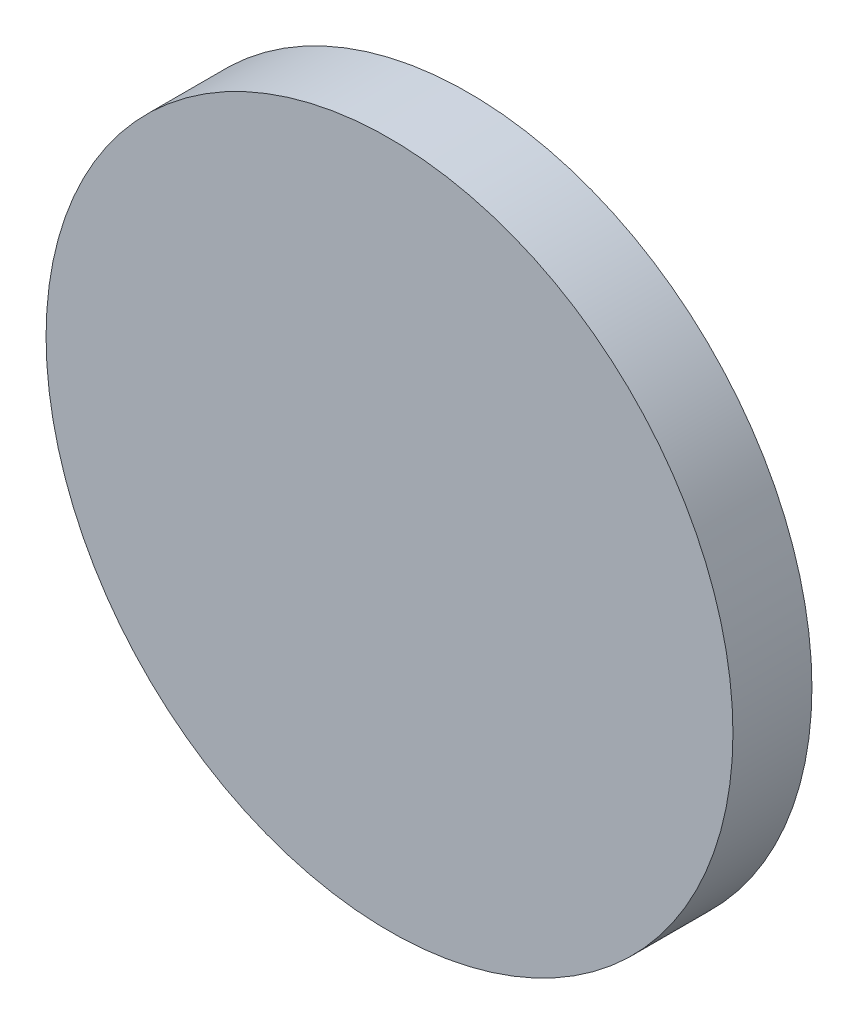
ISO-10303-21;
HEADER;
FILE_DESCRIPTION(('STEP AP214'),'2;1');
FILE_NAME('part.step','',(''),(''),'','','');
FILE_SCHEMA(('AUTOMOTIVE_DESIGN { 1 0 10303 214 1 1 1 1 }'));
ENDSEC;
DATA;
#1=APPLICATION_CONTEXT('core data for automotive mechanical design processes');
#2=APPLICATION_PROTOCOL_DEFINITION('international standard','automotive_design',2000,#1);
#3=PRODUCT_CONTEXT('',#1,'mechanical');
#4=PRODUCT('Part','Part','',(#3));
#5=PRODUCT_RELATED_PRODUCT_CATEGORY('part','',(#4));
#6=PRODUCT_DEFINITION_FORMATION('','',#4);
#7=PRODUCT_DEFINITION_CONTEXT('part definition',#1,'design');
#8=PRODUCT_DEFINITION('design','',#6,#7);
#9=PRODUCT_DEFINITION_SHAPE('','',#8);
#10=(LENGTH_UNIT() NAMED_UNIT(*) SI_UNIT(.MILLI.,.METRE.));
#11=(NAMED_UNIT(*) PLANE_ANGLE_UNIT() SI_UNIT($,.RADIAN.));
#12=(NAMED_UNIT(*) SI_UNIT($,.STERADIAN.) SOLID_ANGLE_UNIT());
#13=UNCERTAINTY_MEASURE_WITH_UNIT(LENGTH_MEASURE(1.E-05),#10,'distance_accuracy_value','');
#14=(GEOMETRIC_REPRESENTATION_CONTEXT(3) GLOBAL_UNCERTAINTY_ASSIGNED_CONTEXT((#13)) GLOBAL_UNIT_ASSIGNED_CONTEXT((#10,
#11,#12)) REPRESENTATION_CONTEXT('',''));
#15=CARTESIAN_POINT('',(0.,0.,0.));
#16=DIRECTION('',(0.,0.,1.));
#17=DIRECTION('',(1.,0.,0.));
#18=AXIS2_PLACEMENT_3D('',#15,#16,#17);
#19=CARTESIAN_POINT('',(72.4099892876148,41.0421612189135,2.3));
#20=DIRECTION('',(0.,0.,-1.));
#21=DIRECTION('',(-1.,0.,0.));
#22=AXIS2_PLACEMENT_3D('',#19,#20,#21);
#23=CYLINDRICAL_SURFACE('',#22,9.999999999);
#24=CARTESIAN_POINT('',(72.4099892876148,41.0421612189135,2.3));
#25=DIRECTION('',(0.,0.,1.));
#26=DIRECTION('',(1.,0.,0.));
#27=AXIS2_PLACEMENT_3D('',#24,#25,#26);
#28=CIRCLE('',#27,9.999999999);
#29=CARTESIAN_POINT('',(82.4099892866148,41.0421612189135,2.3));
#30=VERTEX_POINT('',#29);
#31=EDGE_CURVE('E10',#30,#30,#28,.T.);
#32=ORIENTED_EDGE('',*,*,#31,.F.);
#33=EDGE_LOOP('',(#32));
#34=FACE_BOUND('',#33,.T.);
#35=CARTESIAN_POINT('',(72.4099892876148,41.0421612189135,0.));
#36=DIRECTION('',(0.,0.,1.));
#37=DIRECTION('',(1.,0.,0.));
#38=AXIS2_PLACEMENT_3D('',#35,#36,#37);
#39=CIRCLE('',#38,9.999999999);
#40=CARTESIAN_POINT('',(82.4099892866148,41.0421612189135,0.));
#41=VERTEX_POINT('',#40);
#42=EDGE_CURVE('E38',#41,#41,#39,.T.);
#43=ORIENTED_EDGE('',*,*,#42,.T.);
#44=EDGE_LOOP('',(#43));
#45=FACE_BOUND('',#44,.T.);
#46=ADVANCED_FACE('F35',(#34,#45),#23,.T.);
#47=CARTESIAN_POINT('',(72.4099892876148,41.0421612189135,2.3));
#48=DIRECTION('',(0.,0.,1.));
#49=DIRECTION('',(1.,0.,0.));
#50=AXIS2_PLACEMENT_3D('',#47,#48,#49);
#51=PLANE('',#50);
#52=ORIENTED_EDGE('',*,*,#31,.T.);
#53=EDGE_LOOP('',(#52));
#54=FACE_BOUND('',#53,.T.);
#55=ADVANCED_FACE('F50',(#54),#51,.T.);
#56=CARTESIAN_POINT('',(72.4099892876148,41.0421612189135,0.));
#57=DIRECTION('',(0.,0.,1.));
#58=DIRECTION('',(1.,0.,0.));
#59=AXIS2_PLACEMENT_3D('',#56,#57,#58);
#60=PLANE('',#59);
#61=ORIENTED_EDGE('',*,*,#42,.F.);
#62=EDGE_LOOP('',(#61));
#63=FACE_BOUND('',#62,.T.);
#64=ADVANCED_FACE('F48',(#63),#60,.F.);
#65=CLOSED_SHELL('',(#46,#55,#64));
#66=MANIFOLD_SOLID_BREP('B2',#65);
#67=ADVANCED_BREP_SHAPE_REPRESENTATION('',(#18,#66),#14);
#68=SHAPE_DEFINITION_REPRESENTATION(#9,#67);
ENDSEC;
END-ISO-10303-21;
